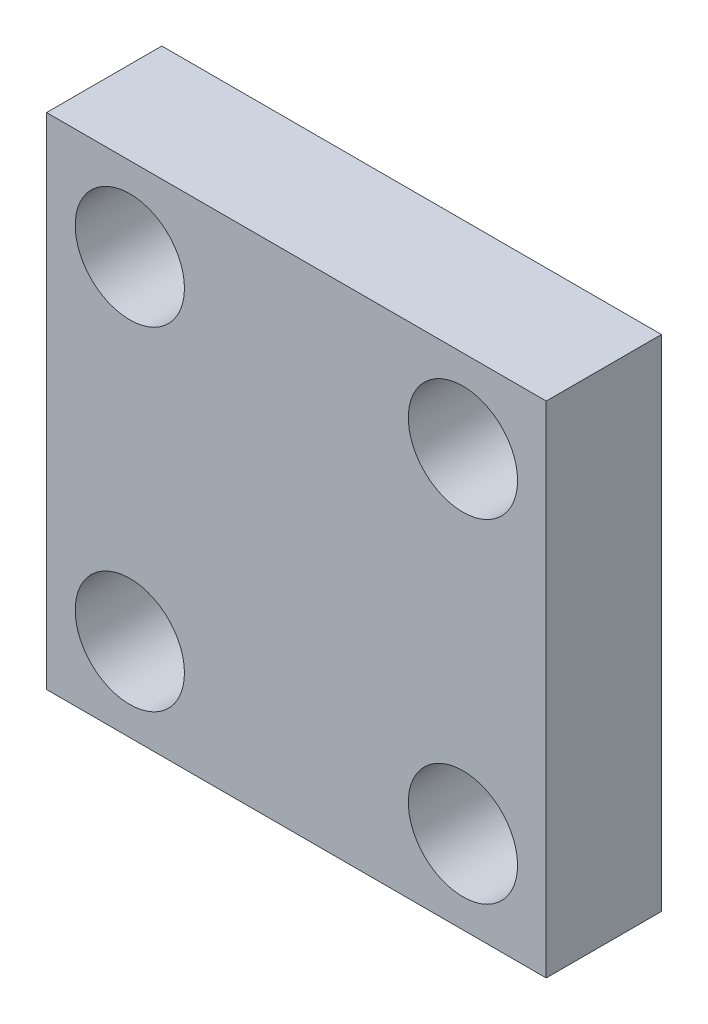
ISO-10303-21;
HEADER;
FILE_DESCRIPTION(('STEP AP214'),'2;1');
FILE_NAME('part.step','',(''),(''),'','','');
FILE_SCHEMA(('AUTOMOTIVE_DESIGN { 1 0 10303 214 1 1 1 1 }'));
ENDSEC;
DATA;
#1=APPLICATION_CONTEXT('core data for automotive mechanical design processes');
#2=APPLICATION_PROTOCOL_DEFINITION('international standard','automotive_design',2000,#1);
#3=PRODUCT_CONTEXT('',#1,'mechanical');
#4=PRODUCT('Part','Part','',(#3));
#5=PRODUCT_RELATED_PRODUCT_CATEGORY('part','',(#4));
#6=PRODUCT_DEFINITION_FORMATION('','',#4);
#7=PRODUCT_DEFINITION_CONTEXT('part definition',#1,'design');
#8=PRODUCT_DEFINITION('design','',#6,#7);
#9=PRODUCT_DEFINITION_SHAPE('','',#8);
#10=(LENGTH_UNIT() NAMED_UNIT(*) SI_UNIT(.MILLI.,.METRE.));
#11=(NAMED_UNIT(*) PLANE_ANGLE_UNIT() SI_UNIT($,.RADIAN.));
#12=(NAMED_UNIT(*) SI_UNIT($,.STERADIAN.) SOLID_ANGLE_UNIT());
#13=UNCERTAINTY_MEASURE_WITH_UNIT(LENGTH_MEASURE(1.E-05),#10,'distance_accuracy_value','');
#14=(GEOMETRIC_REPRESENTATION_CONTEXT(3) GLOBAL_UNCERTAINTY_ASSIGNED_CONTEXT((#13)) GLOBAL_UNIT_ASSIGNED_CONTEXT((#10,
#11,#12)) REPRESENTATION_CONTEXT('',''));
#15=CARTESIAN_POINT('',(0.,0.,0.));
#16=DIRECTION('',(0.,0.,1.));
#17=DIRECTION('',(1.,0.,0.));
#18=AXIS2_PLACEMENT_3D('',#15,#16,#17);
#19=CARTESIAN_POINT('',(0.,0.,4.3942));
#20=DIRECTION('',(0.,0.,-1.));
#21=DIRECTION('',(-1.,0.,0.));
#22=AXIS2_PLACEMENT_3D('',#19,#20,#21);
#23=PLANE('',#22);
#24=CARTESIAN_POINT('',(15.875,15.875,4.3942));
#25=DIRECTION('',(0.,0.,1.));
#26=DIRECTION('',(1.,0.,0.));
#27=AXIS2_PLACEMENT_3D('',#24,#25,#26);
#28=CIRCLE('',#27,2.0828);
#29=CARTESIAN_POINT('',(17.9578,15.875,4.3942));
#30=VERTEX_POINT('',#29);
#31=EDGE_CURVE('E121',#30,#30,#28,.T.);
#32=ORIENTED_EDGE('',*,*,#31,.F.);
#33=EDGE_LOOP('',(#32));
#34=FACE_BOUND('',#33,.T.);
#35=CARTESIAN_POINT('',(3.175,3.175,4.3942));
#36=DIRECTION('',(0.,0.,1.));
#37=DIRECTION('',(1.,0.,0.));
#38=AXIS2_PLACEMENT_3D('',#35,#36,#37);
#39=CIRCLE('',#38,2.0828);
#40=CARTESIAN_POINT('',(5.2578,3.175,4.3942));
#41=VERTEX_POINT('',#40);
#42=EDGE_CURVE('E100',#41,#41,#39,.T.);
#43=ORIENTED_EDGE('',*,*,#42,.F.);
#44=EDGE_LOOP('',(#43));
#45=FACE_BOUND('',#44,.T.);
#46=DIRECTION('',(0.,-1.,0.));
#47=VECTOR('',#46,1.);
#48=CARTESIAN_POINT('',(0.,0.,4.3942));
#49=LINE('',#48,#47);
#50=CARTESIAN_POINT('',(0.,19.05,4.3942));
#51=VERTEX_POINT('',#50);
#52=CARTESIAN_POINT('',(0.,0.,4.3942));
#53=VERTEX_POINT('',#52);
#54=EDGE_CURVE('E85',#51,#53,#49,.T.);
#55=ORIENTED_EDGE('',*,*,#54,.T.);
#56=DIRECTION('',(1.,0.,0.));
#57=VECTOR('',#56,1.);
#58=CARTESIAN_POINT('',(0.,0.,4.3942));
#59=LINE('',#58,#57);
#60=CARTESIAN_POINT('',(19.05,0.,4.3942));
#61=VERTEX_POINT('',#60);
#62=EDGE_CURVE('E80',#53,#61,#59,.T.);
#63=ORIENTED_EDGE('',*,*,#62,.T.);
#64=DIRECTION('',(0.,1.,0.));
#65=VECTOR('',#64,1.);
#66=CARTESIAN_POINT('',(19.05,0.,4.3942));
#67=LINE('',#66,#65);
#68=CARTESIAN_POINT('',(19.05,19.05,4.3942));
#69=VERTEX_POINT('',#68);
#70=EDGE_CURVE('E83',#61,#69,#67,.T.);
#71=ORIENTED_EDGE('',*,*,#70,.T.);
#72=DIRECTION('',(-1.,0.,0.));
#73=VECTOR('',#72,1.);
#74=CARTESIAN_POINT('',(0.,19.05,4.3942));
#75=LINE('',#74,#73);
#76=EDGE_CURVE('E50',#69,#51,#75,.T.);
#77=ORIENTED_EDGE('',*,*,#76,.T.);
#78=EDGE_LOOP('',(#55,#63,#71,#77));
#79=FACE_BOUND('',#78,.T.);
#80=CARTESIAN_POINT('',(3.175,15.875,4.3942));
#81=DIRECTION('',(0.,0.,1.));
#82=DIRECTION('',(1.,0.,0.));
#83=AXIS2_PLACEMENT_3D('',#80,#81,#82);
#84=CIRCLE('',#83,2.08280000000002);
#85=CARTESIAN_POINT('',(5.25780000000002,15.875,4.3942));
#86=VERTEX_POINT('',#85);
#87=EDGE_CURVE('E115',#86,#86,#84,.T.);
#88=ORIENTED_EDGE('',*,*,#87,.F.);
#89=EDGE_LOOP('',(#88));
#90=FACE_BOUND('',#89,.T.);
#91=CARTESIAN_POINT('',(15.875,3.175,4.3942));
#92=DIRECTION('',(0.,0.,1.));
#93=DIRECTION('',(1.,0.,0.));
#94=AXIS2_PLACEMENT_3D('',#91,#92,#93);
#95=CIRCLE('',#94,2.0828);
#96=CARTESIAN_POINT('',(17.9578,3.175,4.3942));
#97=VERTEX_POINT('',#96);
#98=EDGE_CURVE('E127',#97,#97,#95,.T.);
#99=ORIENTED_EDGE('',*,*,#98,.F.);
#100=EDGE_LOOP('',(#99));
#101=FACE_BOUND('',#100,.T.);
#102=ADVANCED_FACE('F33',(#34,#45,#79,#90,#101),#23,.F.);
#103=CARTESIAN_POINT('',(0.,0.,0.));
#104=DIRECTION('',(0.,0.,-1.));
#105=DIRECTION('',(-1.,0.,0.));
#106=AXIS2_PLACEMENT_3D('',#103,#104,#105);
#107=PLANE('',#106);
#108=CARTESIAN_POINT('',(15.875,15.875,0.));
#109=DIRECTION('',(0.,0.,1.));
#110=DIRECTION('',(1.,0.,0.));
#111=AXIS2_PLACEMENT_3D('',#108,#109,#110);
#112=CIRCLE('',#111,2.0828);
#113=CARTESIAN_POINT('',(17.9578,15.875,0.));
#114=VERTEX_POINT('',#113);
#115=EDGE_CURVE('E124',#114,#114,#112,.T.);
#116=ORIENTED_EDGE('',*,*,#115,.T.);
#117=EDGE_LOOP('',(#116));
#118=FACE_BOUND('',#117,.T.);
#119=CARTESIAN_POINT('',(3.175,3.175,0.));
#120=DIRECTION('',(0.,0.,1.));
#121=DIRECTION('',(1.,0.,0.));
#122=AXIS2_PLACEMENT_3D('',#119,#120,#121);
#123=CIRCLE('',#122,2.0828);
#124=CARTESIAN_POINT('',(5.2578,3.175,0.));
#125=VERTEX_POINT('',#124);
#126=EDGE_CURVE('E112',#125,#125,#123,.T.);
#127=ORIENTED_EDGE('',*,*,#126,.T.);
#128=EDGE_LOOP('',(#127));
#129=FACE_BOUND('',#128,.T.);
#130=DIRECTION('',(0.,-1.,0.));
#131=VECTOR('',#130,1.);
#132=CARTESIAN_POINT('',(0.,0.,0.));
#133=LINE('',#132,#131);
#134=CARTESIAN_POINT('',(0.,19.05,0.));
#135=VERTEX_POINT('',#134);
#136=CARTESIAN_POINT('',(0.,0.,0.));
#137=VERTEX_POINT('',#136);
#138=EDGE_CURVE('E97',#135,#137,#133,.T.);
#139=ORIENTED_EDGE('',*,*,#138,.F.);
#140=DIRECTION('',(-1.,0.,0.));
#141=VECTOR('',#140,1.);
#142=CARTESIAN_POINT('',(0.,19.05,0.));
#143=LINE('',#142,#141);
#144=CARTESIAN_POINT('',(19.05,19.05,0.));
#145=VERTEX_POINT('',#144);
#146=EDGE_CURVE('E73',#145,#135,#143,.T.);
#147=ORIENTED_EDGE('',*,*,#146,.F.);
#148=DIRECTION('',(0.,1.,0.));
#149=VECTOR('',#148,1.);
#150=CARTESIAN_POINT('',(19.05,0.,0.));
#151=LINE('',#150,#149);
#152=CARTESIAN_POINT('',(19.05,0.,0.));
#153=VERTEX_POINT('',#152);
#154=EDGE_CURVE('E67',#153,#145,#151,.T.);
#155=ORIENTED_EDGE('',*,*,#154,.F.);
#156=DIRECTION('',(1.,0.,0.));
#157=VECTOR('',#156,1.);
#158=CARTESIAN_POINT('',(0.,0.,0.));
#159=LINE('',#158,#157);
#160=EDGE_CURVE('E89',#137,#153,#159,.T.);
#161=ORIENTED_EDGE('',*,*,#160,.F.);
#162=EDGE_LOOP('',(#139,#147,#155,#161));
#163=FACE_BOUND('',#162,.T.);
#164=CARTESIAN_POINT('',(3.175,15.875,0.));
#165=DIRECTION('',(0.,0.,1.));
#166=DIRECTION('',(1.,0.,0.));
#167=AXIS2_PLACEMENT_3D('',#164,#165,#166);
#168=CIRCLE('',#167,2.08280000000002);
#169=CARTESIAN_POINT('',(5.25780000000002,15.875,0.));
#170=VERTEX_POINT('',#169);
#171=EDGE_CURVE('E118',#170,#170,#168,.T.);
#172=ORIENTED_EDGE('',*,*,#171,.T.);
#173=EDGE_LOOP('',(#172));
#174=FACE_BOUND('',#173,.T.);
#175=CARTESIAN_POINT('',(15.875,3.175,0.));
#176=DIRECTION('',(0.,0.,1.));
#177=DIRECTION('',(1.,0.,0.));
#178=AXIS2_PLACEMENT_3D('',#175,#176,#177);
#179=CIRCLE('',#178,2.0828);
#180=CARTESIAN_POINT('',(17.9578,3.175,0.));
#181=VERTEX_POINT('',#180);
#182=EDGE_CURVE('E130',#181,#181,#179,.T.);
#183=ORIENTED_EDGE('',*,*,#182,.T.);
#184=EDGE_LOOP('',(#183));
#185=FACE_BOUND('',#184,.T.);
#186=ADVANCED_FACE('F108',(#118,#129,#163,#174,#185),#107,.T.);
#187=CARTESIAN_POINT('',(0.,0.,4.3942));
#188=DIRECTION('',(1.,0.,0.));
#189=DIRECTION('',(0.,0.,-1.));
#190=AXIS2_PLACEMENT_3D('',#187,#188,#189);
#191=PLANE('',#190);
#192=ORIENTED_EDGE('',*,*,#138,.T.);
#193=DIRECTION('',(0.,0.,-1.));
#194=VECTOR('',#193,1.);
#195=CARTESIAN_POINT('',(0.,0.,4.3942));
#196=LINE('',#195,#194);
#197=EDGE_CURVE('E11',#53,#137,#196,.T.);
#198=ORIENTED_EDGE('',*,*,#197,.F.);
#199=ORIENTED_EDGE('',*,*,#54,.F.);
#200=DIRECTION('',(0.,0.,-1.));
#201=VECTOR('',#200,1.);
#202=CARTESIAN_POINT('',(0.,19.05,4.3942));
#203=LINE('',#202,#201);
#204=EDGE_CURVE('E93',#51,#135,#203,.T.);
#205=ORIENTED_EDGE('',*,*,#204,.T.);
#206=EDGE_LOOP('',(#192,#198,#199,#205));
#207=FACE_BOUND('',#206,.T.);
#208=ADVANCED_FACE('F35',(#207),#191,.F.);
#209=CARTESIAN_POINT('',(0.,0.,4.3942));
#210=DIRECTION('',(0.,1.,0.));
#211=DIRECTION('',(0.,0.,1.));
#212=AXIS2_PLACEMENT_3D('',#209,#210,#211);
#213=PLANE('',#212);
#214=ORIENTED_EDGE('',*,*,#160,.T.);
#215=DIRECTION('',(0.,0.,-1.));
#216=VECTOR('',#215,1.);
#217=CARTESIAN_POINT('',(19.05,0.,4.3942));
#218=LINE('',#217,#216);
#219=EDGE_CURVE('E42',#61,#153,#218,.T.);
#220=ORIENTED_EDGE('',*,*,#219,.F.);
#221=ORIENTED_EDGE('',*,*,#62,.F.);
#222=ORIENTED_EDGE('',*,*,#197,.T.);
#223=EDGE_LOOP('',(#214,#220,#221,#222));
#224=FACE_BOUND('',#223,.T.);
#225=ADVANCED_FACE('F88',(#224),#213,.F.);
#226=CARTESIAN_POINT('',(19.05,0.,4.3942));
#227=DIRECTION('',(-1.,0.,0.));
#228=DIRECTION('',(0.,0.,1.));
#229=AXIS2_PLACEMENT_3D('',#226,#227,#228);
#230=PLANE('',#229);
#231=ORIENTED_EDGE('',*,*,#154,.T.);
#232=DIRECTION('',(0.,0.,-1.));
#233=VECTOR('',#232,1.);
#234=CARTESIAN_POINT('',(19.05,19.05,4.3942));
#235=LINE('',#234,#233);
#236=EDGE_CURVE('E90',#69,#145,#235,.T.);
#237=ORIENTED_EDGE('',*,*,#236,.F.);
#238=ORIENTED_EDGE('',*,*,#70,.F.);
#239=ORIENTED_EDGE('',*,*,#219,.T.);
#240=EDGE_LOOP('',(#231,#237,#238,#239));
#241=FACE_BOUND('',#240,.T.);
#242=ADVANCED_FACE('F91',(#241),#230,.F.);
#243=CARTESIAN_POINT('',(0.,19.05,4.3942));
#244=DIRECTION('',(0.,-1.,0.));
#245=DIRECTION('',(0.,0.,-1.));
#246=AXIS2_PLACEMENT_3D('',#243,#244,#245);
#247=PLANE('',#246);
#248=ORIENTED_EDGE('',*,*,#146,.T.);
#249=ORIENTED_EDGE('',*,*,#204,.F.);
#250=ORIENTED_EDGE('',*,*,#76,.F.);
#251=ORIENTED_EDGE('',*,*,#236,.T.);
#252=EDGE_LOOP('',(#248,#249,#250,#251));
#253=FACE_BOUND('',#252,.T.);
#254=ADVANCED_FACE('F105',(#253),#247,.F.);
#255=CARTESIAN_POINT('',(3.175,3.175,4.3942));
#256=DIRECTION('',(0.,0.,-1.));
#257=DIRECTION('',(-1.,0.,0.));
#258=AXIS2_PLACEMENT_3D('',#255,#256,#257);
#259=CYLINDRICAL_SURFACE('',#258,2.0828);
#260=ORIENTED_EDGE('',*,*,#42,.T.);
#261=EDGE_LOOP('',(#260));
#262=FACE_BOUND('',#261,.T.);
#263=ORIENTED_EDGE('',*,*,#126,.F.);
#264=EDGE_LOOP('',(#263));
#265=FACE_BOUND('',#264,.T.);
#266=ADVANCED_FACE('F150',(#262,#265),#259,.F.);
#267=CARTESIAN_POINT('',(3.175,15.875,4.3942));
#268=DIRECTION('',(0.,0.,-1.));
#269=DIRECTION('',(-1.,0.,0.));
#270=AXIS2_PLACEMENT_3D('',#267,#268,#269);
#271=CYLINDRICAL_SURFACE('',#270,2.08280000000002);
#272=ORIENTED_EDGE('',*,*,#87,.T.);
#273=EDGE_LOOP('',(#272));
#274=FACE_BOUND('',#273,.T.);
#275=ORIENTED_EDGE('',*,*,#171,.F.);
#276=EDGE_LOOP('',(#275));
#277=FACE_BOUND('',#276,.T.);
#278=ADVANCED_FACE('F196',(#274,#277),#271,.F.);
#279=CARTESIAN_POINT('',(15.875,15.875,4.3942));
#280=DIRECTION('',(0.,0.,-1.));
#281=DIRECTION('',(-1.,0.,0.));
#282=AXIS2_PLACEMENT_3D('',#279,#280,#281);
#283=CYLINDRICAL_SURFACE('',#282,2.0828);
#284=ORIENTED_EDGE('',*,*,#31,.T.);
#285=EDGE_LOOP('',(#284));
#286=FACE_BOUND('',#285,.T.);
#287=ORIENTED_EDGE('',*,*,#115,.F.);
#288=EDGE_LOOP('',(#287));
#289=FACE_BOUND('',#288,.T.);
#290=ADVANCED_FACE('F204',(#286,#289),#283,.F.);
#291=CARTESIAN_POINT('',(15.875,3.175,4.3942));
#292=DIRECTION('',(0.,0.,-1.));
#293=DIRECTION('',(-1.,0.,0.));
#294=AXIS2_PLACEMENT_3D('',#291,#292,#293);
#295=CYLINDRICAL_SURFACE('',#294,2.0828);
#296=ORIENTED_EDGE('',*,*,#98,.T.);
#297=EDGE_LOOP('',(#296));
#298=FACE_BOUND('',#297,.T.);
#299=ORIENTED_EDGE('',*,*,#182,.F.);
#300=EDGE_LOOP('',(#299));
#301=FACE_BOUND('',#300,.T.);
#302=ADVANCED_FACE('F136',(#298,#301),#295,.F.);
#303=CLOSED_SHELL('',(#102,#186,#208,#225,#242,#254,#266,#278,#290,#302));
#304=MANIFOLD_SOLID_BREP('B2',#303);
#305=ADVANCED_BREP_SHAPE_REPRESENTATION('',(#18,#304),#14);
#306=SHAPE_DEFINITION_REPRESENTATION(#9,#305);
ENDSEC;
END-ISO-10303-21;
